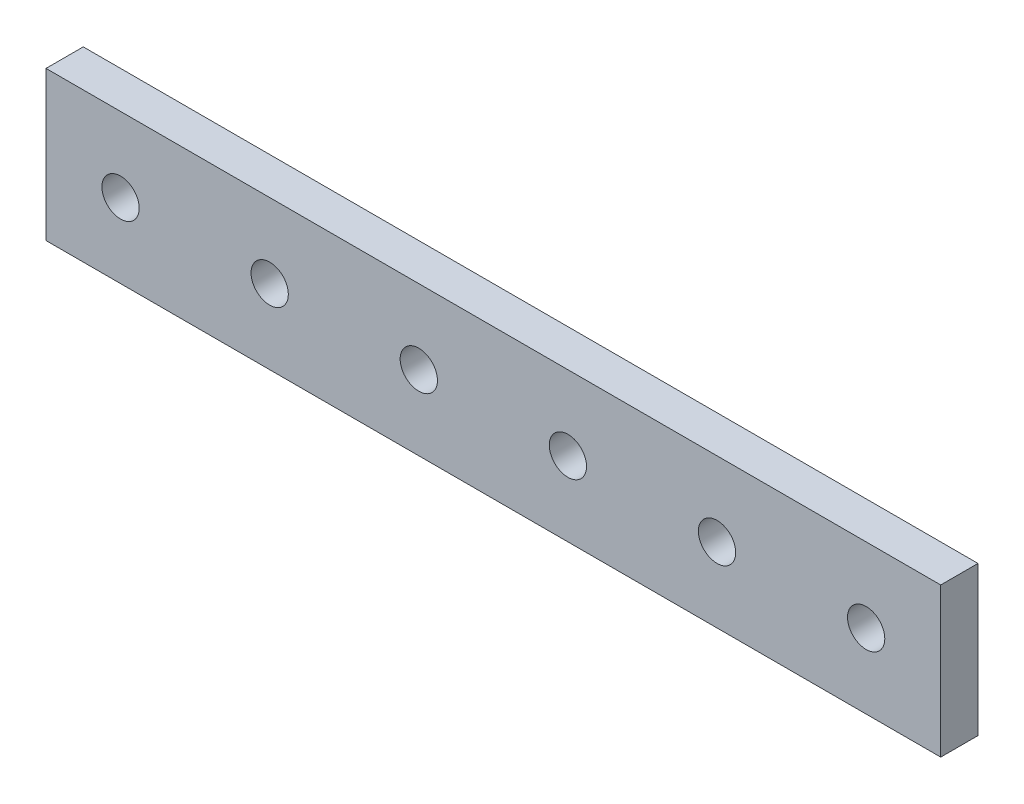
ISO-10303-21;
HEADER;
FILE_DESCRIPTION(('STEP AP214'),'2;1');
FILE_NAME('part.step','',(''),(''),'','','');
FILE_SCHEMA(('AUTOMOTIVE_DESIGN { 1 0 10303 214 1 1 1 1 }'));
ENDSEC;
DATA;
#1=APPLICATION_CONTEXT('core data for automotive mechanical design processes');
#2=APPLICATION_PROTOCOL_DEFINITION('international standard','automotive_design',2000,#1);
#3=PRODUCT_CONTEXT('',#1,'mechanical');
#4=PRODUCT('Part','Part','',(#3));
#5=PRODUCT_RELATED_PRODUCT_CATEGORY('part','',(#4));
#6=PRODUCT_DEFINITION_FORMATION('','',#4);
#7=PRODUCT_DEFINITION_CONTEXT('part definition',#1,'design');
#8=PRODUCT_DEFINITION('design','',#6,#7);
#9=PRODUCT_DEFINITION_SHAPE('','',#8);
#10=(LENGTH_UNIT() NAMED_UNIT(*) SI_UNIT(.MILLI.,.METRE.));
#11=(NAMED_UNIT(*) PLANE_ANGLE_UNIT() SI_UNIT($,.RADIAN.));
#12=(NAMED_UNIT(*) SI_UNIT($,.STERADIAN.) SOLID_ANGLE_UNIT());
#13=UNCERTAINTY_MEASURE_WITH_UNIT(LENGTH_MEASURE(1.E-05),#10,'distance_accuracy_value','');
#14=(GEOMETRIC_REPRESENTATION_CONTEXT(3) GLOBAL_UNCERTAINTY_ASSIGNED_CONTEXT((#13)) GLOBAL_UNIT_ASSIGNED_CONTEXT((#10,
#11,#12)) REPRESENTATION_CONTEXT('',''));
#15=CARTESIAN_POINT('',(0.,0.,0.));
#16=DIRECTION('',(0.,0.,1.));
#17=DIRECTION('',(1.,0.,0.));
#18=AXIS2_PLACEMENT_3D('',#15,#16,#17);
#19=CARTESIAN_POINT('',(76.2,-12.7,6.35));
#20=DIRECTION('',(-1.,0.,0.));
#21=DIRECTION('',(0.,0.,1.));
#22=AXIS2_PLACEMENT_3D('',#19,#20,#21);
#23=PLANE('',#22);
#24=DIRECTION('',(0.,1.,0.));
#25=VECTOR('',#24,1.);
#26=CARTESIAN_POINT('',(76.2,-12.7,0.));
#27=LINE('',#26,#25);
#28=CARTESIAN_POINT('',(76.2,-12.7,0.));
#29=VERTEX_POINT('',#28);
#30=CARTESIAN_POINT('',(76.2,12.7,0.));
#31=VERTEX_POINT('',#30);
#32=EDGE_CURVE('E107',#29,#31,#27,.T.);
#33=ORIENTED_EDGE('',*,*,#32,.T.);
#34=DIRECTION('',(0.,0.,-1.));
#35=VECTOR('',#34,1.);
#36=CARTESIAN_POINT('',(76.2,12.7,6.35));
#37=LINE('',#36,#35);
#38=CARTESIAN_POINT('',(76.2,12.7,6.35));
#39=VERTEX_POINT('',#38);
#40=EDGE_CURVE('E11',#39,#31,#37,.T.);
#41=ORIENTED_EDGE('',*,*,#40,.F.);
#42=DIRECTION('',(0.,1.,0.));
#43=VECTOR('',#42,1.);
#44=CARTESIAN_POINT('',(76.2,-12.7,6.35));
#45=LINE('',#44,#43);
#46=CARTESIAN_POINT('',(76.2,-12.7,6.35));
#47=VERTEX_POINT('',#46);
#48=EDGE_CURVE('E91',#47,#39,#45,.T.);
#49=ORIENTED_EDGE('',*,*,#48,.F.);
#50=DIRECTION('',(0.,0.,-1.));
#51=VECTOR('',#50,1.);
#52=CARTESIAN_POINT('',(76.2,-12.7,6.35));
#53=LINE('',#52,#51);
#54=EDGE_CURVE('E103',#47,#29,#53,.T.);
#55=ORIENTED_EDGE('',*,*,#54,.T.);
#56=EDGE_LOOP('',(#33,#41,#49,#55));
#57=FACE_BOUND('',#56,.T.);
#58=ADVANCED_FACE('F39',(#57),#23,.F.);
#59=CARTESIAN_POINT('',(-76.2,12.7,6.35));
#60=DIRECTION('',(0.,-1.,0.));
#61=DIRECTION('',(0.,0.,-1.));
#62=AXIS2_PLACEMENT_3D('',#59,#60,#61);
#63=PLANE('',#62);
#64=DIRECTION('',(-1.,0.,0.));
#65=VECTOR('',#64,1.);
#66=CARTESIAN_POINT('',(-76.2,12.7,0.));
#67=LINE('',#66,#65);
#68=CARTESIAN_POINT('',(-76.2,12.7,0.));
#69=VERTEX_POINT('',#68);
#70=EDGE_CURVE('E96',#31,#69,#67,.T.);
#71=ORIENTED_EDGE('',*,*,#70,.T.);
#72=DIRECTION('',(0.,0.,-1.));
#73=VECTOR('',#72,1.);
#74=CARTESIAN_POINT('',(-76.2,12.7,6.35));
#75=LINE('',#74,#73);
#76=CARTESIAN_POINT('',(-76.2,12.7,6.35));
#77=VERTEX_POINT('',#76);
#78=EDGE_CURVE('E48',#77,#69,#75,.T.);
#79=ORIENTED_EDGE('',*,*,#78,.F.);
#80=DIRECTION('',(-1.,0.,0.));
#81=VECTOR('',#80,1.);
#82=CARTESIAN_POINT('',(-76.2,12.7,6.35));
#83=LINE('',#82,#81);
#84=EDGE_CURVE('E86',#39,#77,#83,.T.);
#85=ORIENTED_EDGE('',*,*,#84,.F.);
#86=ORIENTED_EDGE('',*,*,#40,.T.);
#87=EDGE_LOOP('',(#71,#79,#85,#86));
#88=FACE_BOUND('',#87,.T.);
#89=ADVANCED_FACE('F95',(#88),#63,.F.);
#90=CARTESIAN_POINT('',(-76.2,-12.7,6.35));
#91=DIRECTION('',(1.,0.,0.));
#92=DIRECTION('',(0.,0.,-1.));
#93=AXIS2_PLACEMENT_3D('',#90,#91,#92);
#94=PLANE('',#93);
#95=DIRECTION('',(0.,-1.,0.));
#96=VECTOR('',#95,1.);
#97=CARTESIAN_POINT('',(-76.2,-12.7,0.));
#98=LINE('',#97,#96);
#99=CARTESIAN_POINT('',(-76.2,-12.7,0.));
#100=VERTEX_POINT('',#99);
#101=EDGE_CURVE('E73',#69,#100,#98,.T.);
#102=ORIENTED_EDGE('',*,*,#101,.T.);
#103=DIRECTION('',(0.,0.,-1.));
#104=VECTOR('',#103,1.);
#105=CARTESIAN_POINT('',(-76.2,-12.7,6.35));
#106=LINE('',#105,#104);
#107=CARTESIAN_POINT('',(-76.2,-12.7,6.35));
#108=VERTEX_POINT('',#107);
#109=EDGE_CURVE('E98',#108,#100,#106,.T.);
#110=ORIENTED_EDGE('',*,*,#109,.F.);
#111=DIRECTION('',(0.,-1.,0.));
#112=VECTOR('',#111,1.);
#113=CARTESIAN_POINT('',(-76.2,-12.7,6.35));
#114=LINE('',#113,#112);
#115=EDGE_CURVE('E89',#77,#108,#114,.T.);
#116=ORIENTED_EDGE('',*,*,#115,.F.);
#117=ORIENTED_EDGE('',*,*,#78,.T.);
#118=EDGE_LOOP('',(#102,#110,#116,#117));
#119=FACE_BOUND('',#118,.T.);
#120=ADVANCED_FACE('F99',(#119),#94,.F.);
#121=CARTESIAN_POINT('',(-76.2,-12.7,6.35));
#122=DIRECTION('',(0.,1.,0.));
#123=DIRECTION('',(0.,0.,1.));
#124=AXIS2_PLACEMENT_3D('',#121,#122,#123);
#125=PLANE('',#124);
#126=DIRECTION('',(1.,0.,0.));
#127=VECTOR('',#126,1.);
#128=CARTESIAN_POINT('',(-76.2,-12.7,0.));
#129=LINE('',#128,#127);
#130=EDGE_CURVE('E79',#100,#29,#129,.T.);
#131=ORIENTED_EDGE('',*,*,#130,.T.);
#132=ORIENTED_EDGE('',*,*,#54,.F.);
#133=DIRECTION('',(1.,0.,0.));
#134=VECTOR('',#133,1.);
#135=CARTESIAN_POINT('',(-76.2,-12.7,6.35));
#136=LINE('',#135,#134);
#137=EDGE_CURVE('E56',#108,#47,#136,.T.);
#138=ORIENTED_EDGE('',*,*,#137,.F.);
#139=ORIENTED_EDGE('',*,*,#109,.T.);
#140=EDGE_LOOP('',(#131,#132,#138,#139));
#141=FACE_BOUND('',#140,.T.);
#142=ADVANCED_FACE('F121',(#141),#125,.F.);
#143=CARTESIAN_POINT('',(0.,0.,6.35));
#144=DIRECTION('',(0.,0.,-1.));
#145=DIRECTION('',(-1.,0.,0.));
#146=AXIS2_PLACEMENT_3D('',#143,#144,#145);
#147=PLANE('',#146);
#148=CARTESIAN_POINT('',(-63.5,0.,6.35));
#149=DIRECTION('',(0.,0.,1.));
#150=DIRECTION('',(1.,0.,0.));
#151=AXIS2_PLACEMENT_3D('',#148,#149,#150);
#152=CIRCLE('',#151,3.17500000000001);
#153=CARTESIAN_POINT('',(-60.325,0.,6.35));
#154=VERTEX_POINT('',#153);
#155=EDGE_CURVE('E136',#154,#154,#152,.T.);
#156=ORIENTED_EDGE('',*,*,#155,.F.);
#157=EDGE_LOOP('',(#156));
#158=FACE_BOUND('',#157,.T.);
#159=CARTESIAN_POINT('',(-38.1,0.,6.35));
#160=DIRECTION('',(0.,0.,1.));
#161=DIRECTION('',(1.,0.,0.));
#162=AXIS2_PLACEMENT_3D('',#159,#160,#161);
#163=CIRCLE('',#162,3.17500000000001);
#164=CARTESIAN_POINT('',(-34.925,0.,6.35));
#165=VERTEX_POINT('',#164);
#166=EDGE_CURVE('E144',#165,#165,#163,.T.);
#167=ORIENTED_EDGE('',*,*,#166,.F.);
#168=EDGE_LOOP('',(#167));
#169=FACE_BOUND('',#168,.T.);
#170=CARTESIAN_POINT('',(12.7,0.,6.35));
#171=DIRECTION('',(0.,0.,1.));
#172=DIRECTION('',(1.,0.,0.));
#173=AXIS2_PLACEMENT_3D('',#170,#171,#172);
#174=CIRCLE('',#173,3.175);
#175=CARTESIAN_POINT('',(15.875,0.,6.35));
#176=VERTEX_POINT('',#175);
#177=EDGE_CURVE('E152',#176,#176,#174,.T.);
#178=ORIENTED_EDGE('',*,*,#177,.F.);
#179=EDGE_LOOP('',(#178));
#180=FACE_BOUND('',#179,.T.);
#181=CARTESIAN_POINT('',(63.5,0.,6.35));
#182=DIRECTION('',(0.,0.,1.));
#183=DIRECTION('',(1.,0.,0.));
#184=AXIS2_PLACEMENT_3D('',#181,#182,#183);
#185=CIRCLE('',#184,3.175);
#186=CARTESIAN_POINT('',(66.675,0.,6.35));
#187=VERTEX_POINT('',#186);
#188=EDGE_CURVE('E160',#187,#187,#185,.T.);
#189=ORIENTED_EDGE('',*,*,#188,.F.);
#190=EDGE_LOOP('',(#189));
#191=FACE_BOUND('',#190,.T.);
#192=CARTESIAN_POINT('',(38.1,0.,6.35));
#193=DIRECTION('',(0.,0.,1.));
#194=DIRECTION('',(1.,0.,0.));
#195=AXIS2_PLACEMENT_3D('',#192,#193,#194);
#196=CIRCLE('',#195,3.17500000000001);
#197=CARTESIAN_POINT('',(41.275,0.,6.35));
#198=VERTEX_POINT('',#197);
#199=EDGE_CURVE('E168',#198,#198,#196,.T.);
#200=ORIENTED_EDGE('',*,*,#199,.F.);
#201=EDGE_LOOP('',(#200));
#202=FACE_BOUND('',#201,.T.);
#203=CARTESIAN_POINT('',(-12.7,0.,6.35));
#204=DIRECTION('',(0.,0.,1.));
#205=DIRECTION('',(1.,0.,0.));
#206=AXIS2_PLACEMENT_3D('',#203,#204,#205);
#207=CIRCLE('',#206,3.17500000000001);
#208=CARTESIAN_POINT('',(-9.52499999999998,0.,6.35));
#209=VERTEX_POINT('',#208);
#210=EDGE_CURVE('E128',#209,#209,#207,.T.);
#211=ORIENTED_EDGE('',*,*,#210,.F.);
#212=EDGE_LOOP('',(#211));
#213=FACE_BOUND('',#212,.T.);
#214=ORIENTED_EDGE('',*,*,#48,.T.);
#215=ORIENTED_EDGE('',*,*,#84,.T.);
#216=ORIENTED_EDGE('',*,*,#115,.T.);
#217=ORIENTED_EDGE('',*,*,#137,.T.);
#218=EDGE_LOOP('',(#214,#215,#216,#217));
#219=FACE_BOUND('',#218,.T.);
#220=ADVANCED_FACE('F87',(#158,#169,#180,#191,#202,#213,#219),#147,.F.);
#221=CARTESIAN_POINT('',(0.,0.,0.));
#222=DIRECTION('',(0.,0.,-1.));
#223=DIRECTION('',(-1.,0.,0.));
#224=AXIS2_PLACEMENT_3D('',#221,#222,#223);
#225=PLANE('',#224);
#226=CARTESIAN_POINT('',(-63.5,0.,0.));
#227=DIRECTION('',(0.,0.,1.));
#228=DIRECTION('',(1.,0.,0.));
#229=AXIS2_PLACEMENT_3D('',#226,#227,#228);
#230=CIRCLE('',#229,3.17500000000001);
#231=CARTESIAN_POINT('',(-60.325,0.,0.));
#232=VERTEX_POINT('',#231);
#233=EDGE_CURVE('E140',#232,#232,#230,.T.);
#234=ORIENTED_EDGE('',*,*,#233,.T.);
#235=EDGE_LOOP('',(#234));
#236=FACE_BOUND('',#235,.T.);
#237=CARTESIAN_POINT('',(-38.1,0.,0.));
#238=DIRECTION('',(0.,0.,1.));
#239=DIRECTION('',(1.,0.,0.));
#240=AXIS2_PLACEMENT_3D('',#237,#238,#239);
#241=CIRCLE('',#240,3.17500000000001);
#242=CARTESIAN_POINT('',(-34.925,0.,0.));
#243=VERTEX_POINT('',#242);
#244=EDGE_CURVE('E148',#243,#243,#241,.T.);
#245=ORIENTED_EDGE('',*,*,#244,.T.);
#246=EDGE_LOOP('',(#245));
#247=FACE_BOUND('',#246,.T.);
#248=CARTESIAN_POINT('',(12.7,0.,0.));
#249=DIRECTION('',(0.,0.,1.));
#250=DIRECTION('',(1.,0.,0.));
#251=AXIS2_PLACEMENT_3D('',#248,#249,#250);
#252=CIRCLE('',#251,3.175);
#253=CARTESIAN_POINT('',(15.875,0.,0.));
#254=VERTEX_POINT('',#253);
#255=EDGE_CURVE('E156',#254,#254,#252,.T.);
#256=ORIENTED_EDGE('',*,*,#255,.T.);
#257=EDGE_LOOP('',(#256));
#258=FACE_BOUND('',#257,.T.);
#259=CARTESIAN_POINT('',(63.5,0.,0.));
#260=DIRECTION('',(0.,0.,1.));
#261=DIRECTION('',(1.,0.,0.));
#262=AXIS2_PLACEMENT_3D('',#259,#260,#261);
#263=CIRCLE('',#262,3.175);
#264=CARTESIAN_POINT('',(66.675,0.,0.));
#265=VERTEX_POINT('',#264);
#266=EDGE_CURVE('E164',#265,#265,#263,.T.);
#267=ORIENTED_EDGE('',*,*,#266,.T.);
#268=EDGE_LOOP('',(#267));
#269=FACE_BOUND('',#268,.T.);
#270=CARTESIAN_POINT('',(38.1,0.,0.));
#271=DIRECTION('',(0.,0.,1.));
#272=DIRECTION('',(1.,0.,0.));
#273=AXIS2_PLACEMENT_3D('',#270,#271,#272);
#274=CIRCLE('',#273,3.17500000000001);
#275=CARTESIAN_POINT('',(41.275,0.,0.));
#276=VERTEX_POINT('',#275);
#277=EDGE_CURVE('E132',#276,#276,#274,.T.);
#278=ORIENTED_EDGE('',*,*,#277,.T.);
#279=EDGE_LOOP('',(#278));
#280=FACE_BOUND('',#279,.T.);
#281=CARTESIAN_POINT('',(-12.7,0.,0.));
#282=DIRECTION('',(0.,0.,1.));
#283=DIRECTION('',(1.,0.,0.));
#284=AXIS2_PLACEMENT_3D('',#281,#282,#283);
#285=CIRCLE('',#284,3.17500000000001);
#286=CARTESIAN_POINT('',(-9.52499999999998,0.,0.));
#287=VERTEX_POINT('',#286);
#288=EDGE_CURVE('E111',#287,#287,#285,.T.);
#289=ORIENTED_EDGE('',*,*,#288,.T.);
#290=EDGE_LOOP('',(#289));
#291=FACE_BOUND('',#290,.T.);
#292=ORIENTED_EDGE('',*,*,#32,.F.);
#293=ORIENTED_EDGE('',*,*,#130,.F.);
#294=ORIENTED_EDGE('',*,*,#101,.F.);
#295=ORIENTED_EDGE('',*,*,#70,.F.);
#296=EDGE_LOOP('',(#292,#293,#294,#295));
#297=FACE_BOUND('',#296,.T.);
#298=ADVANCED_FACE('F124',(#236,#247,#258,#269,#280,#291,#297),#225,.T.);
#299=CARTESIAN_POINT('',(-12.7,0.,0.));
#300=DIRECTION('',(0.,0.,1.));
#301=DIRECTION('',(1.,0.,0.));
#302=AXIS2_PLACEMENT_3D('',#299,#300,#301);
#303=CYLINDRICAL_SURFACE('',#302,3.17500000000001);
#304=ORIENTED_EDGE('',*,*,#288,.F.);
#305=EDGE_LOOP('',(#304));
#306=FACE_BOUND('',#305,.T.);
#307=ORIENTED_EDGE('',*,*,#210,.T.);
#308=EDGE_LOOP('',(#307));
#309=FACE_BOUND('',#308,.T.);
#310=ADVANCED_FACE('F182',(#306,#309),#303,.F.);
#311=CARTESIAN_POINT('',(38.1,0.,0.));
#312=DIRECTION('',(0.,0.,1.));
#313=DIRECTION('',(1.,0.,0.));
#314=AXIS2_PLACEMENT_3D('',#311,#312,#313);
#315=CYLINDRICAL_SURFACE('',#314,3.17500000000001);
#316=ORIENTED_EDGE('',*,*,#277,.F.);
#317=EDGE_LOOP('',(#316));
#318=FACE_BOUND('',#317,.T.);
#319=ORIENTED_EDGE('',*,*,#199,.T.);
#320=EDGE_LOOP('',(#319));
#321=FACE_BOUND('',#320,.T.);
#322=ADVANCED_FACE('F178',(#318,#321),#315,.F.);
#323=CARTESIAN_POINT('',(63.5,0.,0.));
#324=DIRECTION('',(0.,0.,1.));
#325=DIRECTION('',(1.,0.,0.));
#326=AXIS2_PLACEMENT_3D('',#323,#324,#325);
#327=CYLINDRICAL_SURFACE('',#326,3.175);
#328=ORIENTED_EDGE('',*,*,#266,.F.);
#329=EDGE_LOOP('',(#328));
#330=FACE_BOUND('',#329,.T.);
#331=ORIENTED_EDGE('',*,*,#188,.T.);
#332=EDGE_LOOP('',(#331));
#333=FACE_BOUND('',#332,.T.);
#334=ADVANCED_FACE('F181',(#330,#333),#327,.F.);
#335=CARTESIAN_POINT('',(12.7,0.,0.));
#336=DIRECTION('',(0.,0.,1.));
#337=DIRECTION('',(1.,0.,0.));
#338=AXIS2_PLACEMENT_3D('',#335,#336,#337);
#339=CYLINDRICAL_SURFACE('',#338,3.175);
#340=ORIENTED_EDGE('',*,*,#255,.F.);
#341=EDGE_LOOP('',(#340));
#342=FACE_BOUND('',#341,.T.);
#343=ORIENTED_EDGE('',*,*,#177,.T.);
#344=EDGE_LOOP('',(#343));
#345=FACE_BOUND('',#344,.T.);
#346=ADVANCED_FACE('F243',(#342,#345),#339,.F.);
#347=CARTESIAN_POINT('',(-38.1,0.,0.));
#348=DIRECTION('',(0.,0.,1.));
#349=DIRECTION('',(1.,0.,0.));
#350=AXIS2_PLACEMENT_3D('',#347,#348,#349);
#351=CYLINDRICAL_SURFACE('',#350,3.17500000000001);
#352=ORIENTED_EDGE('',*,*,#244,.F.);
#353=EDGE_LOOP('',(#352));
#354=FACE_BOUND('',#353,.T.);
#355=ORIENTED_EDGE('',*,*,#166,.T.);
#356=EDGE_LOOP('',(#355));
#357=FACE_BOUND('',#356,.T.);
#358=ADVANCED_FACE('F253',(#354,#357),#351,.F.);
#359=CARTESIAN_POINT('',(-63.5,0.,0.));
#360=DIRECTION('',(0.,0.,1.));
#361=DIRECTION('',(1.,0.,0.));
#362=AXIS2_PLACEMENT_3D('',#359,#360,#361);
#363=CYLINDRICAL_SURFACE('',#362,3.17500000000001);
#364=ORIENTED_EDGE('',*,*,#233,.F.);
#365=EDGE_LOOP('',(#364));
#366=FACE_BOUND('',#365,.T.);
#367=ORIENTED_EDGE('',*,*,#155,.T.);
#368=EDGE_LOOP('',(#367));
#369=FACE_BOUND('',#368,.T.);
#370=ADVANCED_FACE('F263',(#366,#369),#363,.F.);
#371=CLOSED_SHELL('',(#58,#89,#120,#142,#220,#298,#310,#322,#334,#346,#358,#370));
#372=MANIFOLD_SOLID_BREP('B2',#371);
#373=ADVANCED_BREP_SHAPE_REPRESENTATION('',(#18,#372),#14);
#374=SHAPE_DEFINITION_REPRESENTATION(#9,#373);
ENDSEC;
END-ISO-10303-21;
